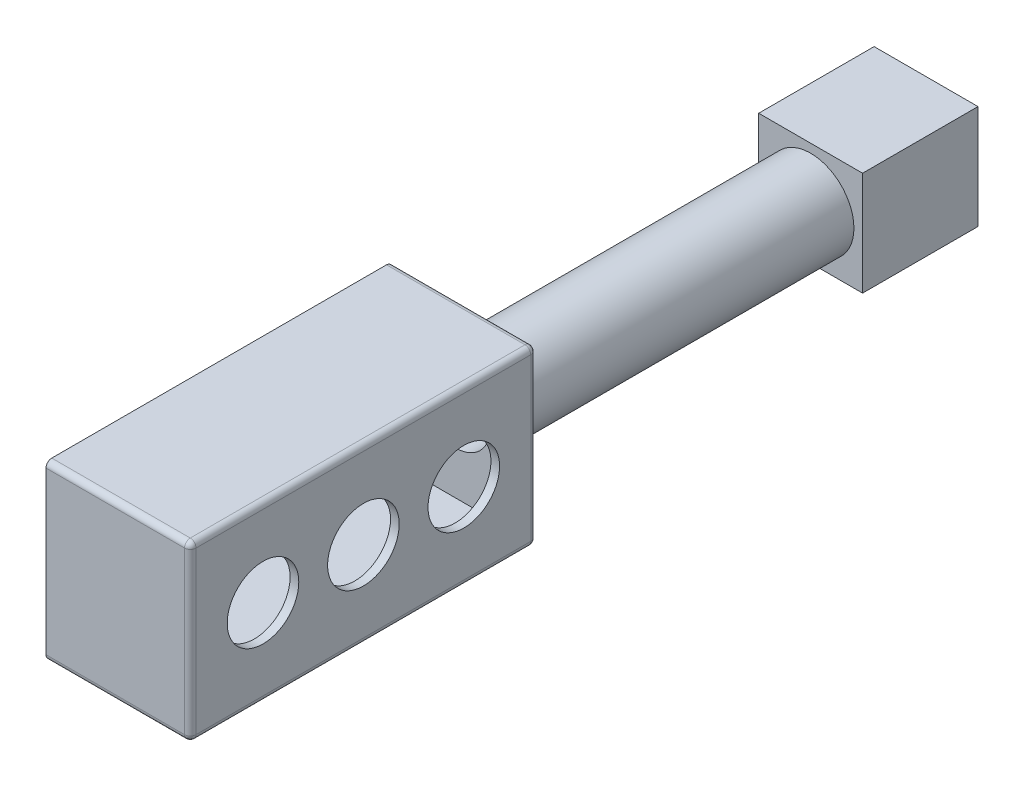
ISO-10303-21;
HEADER;
FILE_DESCRIPTION(('STEP AP214'),'2;1');
FILE_NAME('part.step','',(''),(''),'','','');
FILE_SCHEMA(('AUTOMOTIVE_DESIGN { 1 0 10303 214 1 1 1 1 }'));
ENDSEC;
DATA;
#1=APPLICATION_CONTEXT('core data for automotive mechanical design processes');
#2=APPLICATION_PROTOCOL_DEFINITION('international standard','automotive_design',2000,#1);
#3=PRODUCT_CONTEXT('',#1,'mechanical');
#4=PRODUCT('Part','Part','',(#3));
#5=PRODUCT_RELATED_PRODUCT_CATEGORY('part','',(#4));
#6=PRODUCT_DEFINITION_FORMATION('','',#4);
#7=PRODUCT_DEFINITION_CONTEXT('part definition',#1,'design');
#8=PRODUCT_DEFINITION('design','',#6,#7);
#9=PRODUCT_DEFINITION_SHAPE('','',#8);
#10=(LENGTH_UNIT() NAMED_UNIT(*) SI_UNIT(.MILLI.,.METRE.));
#11=(NAMED_UNIT(*) PLANE_ANGLE_UNIT() SI_UNIT($,.RADIAN.));
#12=(NAMED_UNIT(*) SI_UNIT($,.STERADIAN.) SOLID_ANGLE_UNIT());
#13=UNCERTAINTY_MEASURE_WITH_UNIT(LENGTH_MEASURE(1.E-05),#10,'distance_accuracy_value','');
#14=(GEOMETRIC_REPRESENTATION_CONTEXT(3) GLOBAL_UNCERTAINTY_ASSIGNED_CONTEXT((#13)) GLOBAL_UNIT_ASSIGNED_CONTEXT((#10,
#11,#12)) REPRESENTATION_CONTEXT('',''));
#15=CARTESIAN_POINT('',(0.,0.,0.));
#16=DIRECTION('',(0.,0.,1.));
#17=DIRECTION('',(1.,0.,0.));
#18=AXIS2_PLACEMENT_3D('',#15,#16,#17);
#19=CARTESIAN_POINT('',(-7.5,-7.5,-18.5));
#20=DIRECTION('',(0.,-1.,0.));
#21=DIRECTION('',(0.,0.,-1.));
#22=AXIS2_PLACEMENT_3D('',#19,#20,#21);
#23=PLANE('',#22);
#24=DIRECTION('',(0.,0.,1.));
#25=VECTOR('',#24,1.);
#26=CARTESIAN_POINT('',(7.5,-7.5,-18.5));
#27=LINE('',#26,#25);
#28=CARTESIAN_POINT('',(7.5,-7.5,-10.));
#29=VERTEX_POINT('',#28);
#30=CARTESIAN_POINT('',(7.5,-7.5,-1.5));
#31=VERTEX_POINT('',#30);
#32=EDGE_CURVE('E208',#29,#31,#27,.T.);
#33=ORIENTED_EDGE('',*,*,#32,.F.);
#34=CARTESIAN_POINT('',(0.,-7.5,-10.));
#35=DIRECTION('',(0.,-1.,0.));
#36=DIRECTION('',(0.,0.,-1.));
#37=AXIS2_PLACEMENT_3D('',#34,#35,#36);
#38=CIRCLE('',#37,7.5);
#39=CARTESIAN_POINT('',(-7.5,-7.5,-10.));
#40=VERTEX_POINT('',#39);
#41=EDGE_CURVE('E197',#29,#40,#38,.T.);
#42=ORIENTED_EDGE('',*,*,#41,.T.);
#43=DIRECTION('',(0.,0.,1.));
#44=VECTOR('',#43,1.);
#45=CARTESIAN_POINT('',(-7.5,-7.5,-18.5));
#46=LINE('',#45,#44);
#47=CARTESIAN_POINT('',(-7.5,-7.5,-1.5));
#48=VERTEX_POINT('',#47);
#49=EDGE_CURVE('E206',#40,#48,#46,.T.);
#50=ORIENTED_EDGE('',*,*,#49,.T.);
#51=DIRECTION('',(1.,0.,0.));
#52=VECTOR('',#51,1.);
#53=CARTESIAN_POINT('',(-7.5,-7.5,-1.5));
#54=LINE('',#53,#52);
#55=EDGE_CURVE('E420',#48,#31,#54,.T.);
#56=ORIENTED_EDGE('',*,*,#55,.T.);
#57=EDGE_LOOP('',(#33,#42,#50,#56));
#58=FACE_BOUND('',#57,.T.);
#59=ADVANCED_FACE('F40',(#58),#23,.F.);
#60=CARTESIAN_POINT('',(7.5,7.5,-18.5));
#61=DIRECTION('',(1.,0.,0.));
#62=DIRECTION('',(0.,1.,0.));
#63=AXIS2_PLACEMENT_3D('',#60,#61,#62);
#64=PLANE('',#63);
#65=DIRECTION('',(0.,1.,0.));
#66=VECTOR('',#65,1.);
#67=CARTESIAN_POINT('',(7.5,7.5,-1.5));
#68=LINE('',#67,#66);
#69=CARTESIAN_POINT('',(7.5,7.5,-1.5));
#70=VERTEX_POINT('',#69);
#71=EDGE_CURVE('E415',#31,#70,#68,.T.);
#72=ORIENTED_EDGE('',*,*,#71,.T.);
#73=DIRECTION('',(0.,0.,1.));
#74=VECTOR('',#73,1.);
#75=CARTESIAN_POINT('',(7.5,7.5,-18.5));
#76=LINE('',#75,#74);
#77=CARTESIAN_POINT('',(7.5,7.5,-18.5));
#78=VERTEX_POINT('',#77);
#79=EDGE_CURVE('E230',#78,#70,#76,.T.);
#80=ORIENTED_EDGE('',*,*,#79,.F.);
#81=DIRECTION('',(0.,1.,0.));
#82=VECTOR('',#81,1.);
#83=CARTESIAN_POINT('',(7.5,7.5,-18.5));
#84=LINE('',#83,#82);
#85=CARTESIAN_POINT('',(7.5,-7.5,-18.5));
#86=VERTEX_POINT('',#85);
#87=EDGE_CURVE('E416',#86,#78,#84,.T.);
#88=ORIENTED_EDGE('',*,*,#87,.F.);
#89=EDGE_CURVE('E225',#86,#29,#27,.T.);
#90=ORIENTED_EDGE('',*,*,#89,.T.);
#91=ORIENTED_EDGE('',*,*,#32,.T.);
#92=EDGE_LOOP('',(#72,#80,#88,#90,#91));
#93=FACE_BOUND('',#92,.T.);
#94=ADVANCED_FACE('F436',(#93),#64,.F.);
#95=CARTESIAN_POINT('',(-7.5,-7.5,-18.5));
#96=VERTEX_POINT('',#95);
#97=EDGE_CURVE('E214',#96,#40,#46,.T.);
#98=ORIENTED_EDGE('',*,*,#97,.T.);
#99=EDGE_CURVE('E193',#40,#29,#38,.T.);
#100=ORIENTED_EDGE('',*,*,#99,.T.);
#101=ORIENTED_EDGE('',*,*,#89,.F.);
#102=DIRECTION('',(1.,0.,0.));
#103=VECTOR('',#102,1.);
#104=CARTESIAN_POINT('',(-7.5,-7.5,-18.5));
#105=LINE('',#104,#103);
#106=EDGE_CURVE('E224',#96,#86,#105,.T.);
#107=ORIENTED_EDGE('',*,*,#106,.F.);
#108=EDGE_LOOP('',(#98,#100,#101,#107));
#109=FACE_BOUND('',#108,.T.);
#110=ADVANCED_FACE('F222',(#109),#23,.F.);
#111=CARTESIAN_POINT('',(-7.5,7.5,-18.5));
#112=DIRECTION('',(-1.,0.,0.));
#113=DIRECTION('',(0.,-1.,0.));
#114=AXIS2_PLACEMENT_3D('',#111,#112,#113);
#115=PLANE('',#114);
#116=DIRECTION('',(0.,-1.,0.));
#117=VECTOR('',#116,1.);
#118=CARTESIAN_POINT('',(-7.5,7.5,-1.5));
#119=LINE('',#118,#117);
#120=CARTESIAN_POINT('',(-7.5,7.5,-1.5));
#121=VERTEX_POINT('',#120);
#122=EDGE_CURVE('E217',#121,#48,#119,.T.);
#123=ORIENTED_EDGE('',*,*,#122,.T.);
#124=ORIENTED_EDGE('',*,*,#49,.F.);
#125=ORIENTED_EDGE('',*,*,#97,.F.);
#126=DIRECTION('',(0.,-1.,0.));
#127=VECTOR('',#126,1.);
#128=CARTESIAN_POINT('',(-7.5,7.5,-18.5));
#129=LINE('',#128,#127);
#130=CARTESIAN_POINT('',(-7.5,7.5,-18.5));
#131=VERTEX_POINT('',#130);
#132=EDGE_CURVE('E423',#131,#96,#129,.T.);
#133=ORIENTED_EDGE('',*,*,#132,.F.);
#134=DIRECTION('',(0.,0.,1.));
#135=VECTOR('',#134,1.);
#136=CARTESIAN_POINT('',(-7.5,7.5,-18.5));
#137=LINE('',#136,#135);
#138=EDGE_CURVE('E219',#131,#121,#137,.T.);
#139=ORIENTED_EDGE('',*,*,#138,.T.);
#140=EDGE_LOOP('',(#123,#124,#125,#133,#139));
#141=FACE_BOUND('',#140,.T.);
#142=ADVANCED_FACE('F212',(#141),#115,.F.);
#143=CARTESIAN_POINT('',(-7.5,7.5,-18.5));
#144=DIRECTION('',(0.,1.,0.));
#145=DIRECTION('',(0.,0.,1.));
#146=AXIS2_PLACEMENT_3D('',#143,#144,#145);
#147=PLANE('',#146);
#148=DIRECTION('',(-1.,0.,0.));
#149=VECTOR('',#148,1.);
#150=CARTESIAN_POINT('',(-7.5,7.5,-1.5));
#151=LINE('',#150,#149);
#152=EDGE_CURVE('E428',#70,#121,#151,.T.);
#153=ORIENTED_EDGE('',*,*,#152,.T.);
#154=ORIENTED_EDGE('',*,*,#138,.F.);
#155=DIRECTION('',(-1.,0.,0.));
#156=VECTOR('',#155,1.);
#157=CARTESIAN_POINT('',(-7.5,7.5,-18.5));
#158=LINE('',#157,#156);
#159=EDGE_CURVE('E419',#78,#131,#158,.T.);
#160=ORIENTED_EDGE('',*,*,#159,.F.);
#161=ORIENTED_EDGE('',*,*,#79,.T.);
#162=EDGE_LOOP('',(#153,#154,#160,#161));
#163=FACE_BOUND('',#162,.T.);
#164=ADVANCED_FACE('F442',(#163),#147,.F.);
#165=CARTESIAN_POINT('',(0.,0.,-18.5));
#166=DIRECTION('',(0.,0.,1.));
#167=DIRECTION('',(1.,0.,0.));
#168=AXIS2_PLACEMENT_3D('',#165,#166,#167);
#169=PLANE('',#168);
#170=ORIENTED_EDGE('',*,*,#87,.T.);
#171=ORIENTED_EDGE('',*,*,#159,.T.);
#172=ORIENTED_EDGE('',*,*,#132,.T.);
#173=ORIENTED_EDGE('',*,*,#106,.T.);
#174=EDGE_LOOP('',(#170,#171,#172,#173));
#175=FACE_BOUND('',#174,.T.);
#176=ADVANCED_FACE('F440',(#175),#169,.T.);
#177=CARTESIAN_POINT('',(0.,0.,-1.5));
#178=DIRECTION('',(0.,0.,1.));
#179=DIRECTION('',(1.,0.,0.));
#180=AXIS2_PLACEMENT_3D('',#177,#178,#179);
#181=PLANE('',#180);
#182=CARTESIAN_POINT('',(0.,0.,-1.5));
#183=DIRECTION('',(0.,0.,1.));
#184=DIRECTION('',(1.,0.,0.));
#185=AXIS2_PLACEMENT_3D('',#182,#183,#184);
#186=CIRCLE('',#185,6.);
#187=CARTESIAN_POINT('',(6.,0.,-1.5));
#188=VERTEX_POINT('',#187);
#189=EDGE_CURVE('E210',#188,#188,#186,.T.);
#190=ORIENTED_EDGE('',*,*,#189,.T.);
#191=EDGE_LOOP('',(#190));
#192=FACE_BOUND('',#191,.T.);
#193=ORIENTED_EDGE('',*,*,#71,.F.);
#194=ORIENTED_EDGE('',*,*,#55,.F.);
#195=ORIENTED_EDGE('',*,*,#122,.F.);
#196=ORIENTED_EDGE('',*,*,#152,.F.);
#197=EDGE_LOOP('',(#193,#194,#195,#196));
#198=FACE_BOUND('',#197,.T.);
#199=ADVANCED_FACE('F433',(#192,#198),#181,.F.);
#200=CARTESIAN_POINT('',(11.,-15.,120.));
#201=DIRECTION('',(-1.,0.,0.));
#202=DIRECTION('',(0.,0.,1.));
#203=AXIS2_PLACEMENT_3D('',#200,#201,#202);
#204=PLANE('',#203);
#205=DIRECTION('',(0.,1.,0.));
#206=VECTOR('',#205,1.);
#207=CARTESIAN_POINT('',(11.,0.,61.5));
#208=LINE('',#207,#206);
#209=CARTESIAN_POINT('',(11.,-13.5,61.5));
#210=VERTEX_POINT('',#209);
#211=CARTESIAN_POINT('',(11.,13.5,61.5));
#212=VERTEX_POINT('',#211);
#213=EDGE_CURVE('E281',#210,#212,#208,.T.);
#214=ORIENTED_EDGE('',*,*,#213,.F.);
#215=DIRECTION('',(0.,0.,-1.));
#216=VECTOR('',#215,1.);
#217=CARTESIAN_POINT('',(11.,-13.5,120.));
#218=LINE('',#217,#216);
#219=CARTESIAN_POINT('',(11.,-13.5,118.5));
#220=VERTEX_POINT('',#219);
#221=EDGE_CURVE('E297',#220,#210,#218,.T.);
#222=ORIENTED_EDGE('',*,*,#221,.F.);
#223=DIRECTION('',(0.,1.,0.));
#224=VECTOR('',#223,1.);
#225=CARTESIAN_POINT('',(11.,0.,118.5));
#226=LINE('',#225,#224);
#227=CARTESIAN_POINT('',(11.,13.5,118.5));
#228=VERTEX_POINT('',#227);
#229=EDGE_CURVE('E294',#220,#228,#226,.T.);
#230=ORIENTED_EDGE('',*,*,#229,.T.);
#231=DIRECTION('',(0.,0.,-1.));
#232=VECTOR('',#231,1.);
#233=CARTESIAN_POINT('',(11.,13.5,120.));
#234=LINE('',#233,#232);
#235=EDGE_CURVE('E288',#228,#212,#234,.T.);
#236=ORIENTED_EDGE('',*,*,#235,.T.);
#237=EDGE_LOOP('',(#214,#222,#230,#236));
#238=FACE_BOUND('',#237,.T.);
#239=CARTESIAN_POINT('',(11.,0.,107.4));
#240=DIRECTION('',(1.,0.,0.));
#241=DIRECTION('',(0.,0.,-1.));
#242=AXIS2_PLACEMENT_3D('',#239,#240,#241);
#243=CIRCLE('',#242,6.2);
#244=CARTESIAN_POINT('',(11.,0.,101.2));
#245=VERTEX_POINT('',#244);
#246=EDGE_CURVE('E269',#245,#245,#243,.T.);
#247=ORIENTED_EDGE('',*,*,#246,.T.);
#248=EDGE_LOOP('',(#247));
#249=FACE_BOUND('',#248,.T.);
#250=CARTESIAN_POINT('',(11.,0.,72.6));
#251=DIRECTION('',(1.,0.,0.));
#252=DIRECTION('',(0.,0.,1.));
#253=AXIS2_PLACEMENT_3D('',#250,#251,#252);
#254=CIRCLE('',#253,6.2);
#255=CARTESIAN_POINT('',(11.,0.,78.8));
#256=VERTEX_POINT('',#255);
#257=EDGE_CURVE('E275',#256,#256,#254,.T.);
#258=ORIENTED_EDGE('',*,*,#257,.T.);
#259=EDGE_LOOP('',(#258));
#260=FACE_BOUND('',#259,.T.);
#261=CARTESIAN_POINT('',(11.,0.,90.));
#262=DIRECTION('',(1.,0.,0.));
#263=DIRECTION('',(0.,0.,-1.));
#264=AXIS2_PLACEMENT_3D('',#261,#262,#263);
#265=CIRCLE('',#264,6.2);
#266=CARTESIAN_POINT('',(11.,0.,83.8));
#267=VERTEX_POINT('',#266);
#268=EDGE_CURVE('E278',#267,#267,#265,.T.);
#269=ORIENTED_EDGE('',*,*,#268,.T.);
#270=EDGE_LOOP('',(#269));
#271=FACE_BOUND('',#270,.T.);
#272=ADVANCED_FACE('F509',(#238,#249,#260,#271),#204,.T.);
#273=CARTESIAN_POINT('',(-12.5,-15.,120.));
#274=DIRECTION('',(1.,0.,0.));
#275=DIRECTION('',(0.,0.,-1.));
#276=AXIS2_PLACEMENT_3D('',#273,#274,#275);
#277=PLANE('',#276);
#278=DIRECTION('',(0.,0.,-1.));
#279=VECTOR('',#278,1.);
#280=CARTESIAN_POINT('',(-12.5,-15.,120.));
#281=LINE('',#280,#279);
#282=CARTESIAN_POINT('',(-12.5,-15.,119.));
#283=VERTEX_POINT('',#282);
#284=CARTESIAN_POINT('',(-12.5,-15.,61.));
#285=VERTEX_POINT('',#284);
#286=EDGE_CURVE('E322',#283,#285,#281,.T.);
#287=ORIENTED_EDGE('',*,*,#286,.F.);
#288=CARTESIAN_POINT('',(-12.5,-14.,119.));
#289=DIRECTION('',(1.,0.,0.));
#290=DIRECTION('',(0.,0.,-1.));
#291=AXIS2_PLACEMENT_3D('',#288,#289,#290);
#292=CIRCLE('',#291,1.);
#293=CARTESIAN_POINT('',(-12.5,-14.,120.));
#294=VERTEX_POINT('',#293);
#295=EDGE_CURVE('E354',#283,#294,#292,.F.);
#296=ORIENTED_EDGE('',*,*,#295,.T.);
#297=DIRECTION('',(0.,-1.,0.));
#298=VECTOR('',#297,1.);
#299=CARTESIAN_POINT('',(-12.5,-15.,120.));
#300=LINE('',#299,#298);
#301=CARTESIAN_POINT('',(-12.5,14.,120.));
#302=VERTEX_POINT('',#301);
#303=EDGE_CURVE('E319',#302,#294,#300,.T.);
#304=ORIENTED_EDGE('',*,*,#303,.F.);
#305=CARTESIAN_POINT('',(-12.5,14.,119.));
#306=DIRECTION('',(1.,0.,0.));
#307=DIRECTION('',(0.,0.,-1.));
#308=AXIS2_PLACEMENT_3D('',#305,#306,#307);
#309=CIRCLE('',#308,1.);
#310=CARTESIAN_POINT('',(-12.5,15.,119.));
#311=VERTEX_POINT('',#310);
#312=EDGE_CURVE('E348',#302,#311,#309,.F.);
#313=ORIENTED_EDGE('',*,*,#312,.T.);
#314=DIRECTION('',(0.,0.,-1.));
#315=VECTOR('',#314,1.);
#316=CARTESIAN_POINT('',(-12.5,15.,120.));
#317=LINE('',#316,#315);
#318=CARTESIAN_POINT('',(-12.5,15.,61.));
#319=VERTEX_POINT('',#318);
#320=EDGE_CURVE('E327',#311,#319,#317,.T.);
#321=ORIENTED_EDGE('',*,*,#320,.T.);
#322=CARTESIAN_POINT('',(-12.5,14.,61.));
#323=DIRECTION('',(1.,0.,0.));
#324=DIRECTION('',(0.,0.,-1.));
#325=AXIS2_PLACEMENT_3D('',#322,#323,#324);
#326=CIRCLE('',#325,1.);
#327=CARTESIAN_POINT('',(-12.5,14.,60.));
#328=VERTEX_POINT('',#327);
#329=EDGE_CURVE('E350',#319,#328,#326,.F.);
#330=ORIENTED_EDGE('',*,*,#329,.T.);
#331=DIRECTION('',(0.,-1.,0.));
#332=VECTOR('',#331,1.);
#333=CARTESIAN_POINT('',(-12.5,-15.,60.));
#334=LINE('',#333,#332);
#335=CARTESIAN_POINT('',(-12.5,-14.,60.));
#336=VERTEX_POINT('',#335);
#337=EDGE_CURVE('E287',#328,#336,#334,.T.);
#338=ORIENTED_EDGE('',*,*,#337,.T.);
#339=CARTESIAN_POINT('',(-12.5,-14.,61.));
#340=DIRECTION('',(1.,0.,0.));
#341=DIRECTION('',(0.,0.,-1.));
#342=AXIS2_PLACEMENT_3D('',#339,#340,#341);
#343=CIRCLE('',#342,1.);
#344=EDGE_CURVE('E352',#336,#285,#343,.F.);
#345=ORIENTED_EDGE('',*,*,#344,.T.);
#346=EDGE_LOOP('',(#287,#296,#304,#313,#321,#330,#338,#345));
#347=FACE_BOUND('',#346,.T.);
#348=DIRECTION('',(0.,-1.,0.));
#349=VECTOR('',#348,1.);
#350=CARTESIAN_POINT('',(-12.5,0.,61.5));
#351=LINE('',#350,#349);
#352=CARTESIAN_POINT('',(-12.5,13.5,61.5));
#353=VERTEX_POINT('',#352);
#354=CARTESIAN_POINT('',(-12.5,-13.5,61.5));
#355=VERTEX_POINT('',#354);
#356=EDGE_CURVE('E295',#353,#355,#351,.T.);
#357=ORIENTED_EDGE('',*,*,#356,.F.);
#358=DIRECTION('',(0.,0.,-1.));
#359=VECTOR('',#358,1.);
#360=CARTESIAN_POINT('',(-12.5,13.5,120.));
#361=LINE('',#360,#359);
#362=CARTESIAN_POINT('',(-12.5,13.5,118.5));
#363=VERTEX_POINT('',#362);
#364=EDGE_CURVE('E311',#363,#353,#361,.T.);
#365=ORIENTED_EDGE('',*,*,#364,.F.);
#366=DIRECTION('',(0.,-1.,0.));
#367=VECTOR('',#366,1.);
#368=CARTESIAN_POINT('',(-12.5,0.,118.5));
#369=LINE('',#368,#367);
#370=CARTESIAN_POINT('',(-12.5,-13.5,118.5));
#371=VERTEX_POINT('',#370);
#372=EDGE_CURVE('E303',#363,#371,#369,.T.);
#373=ORIENTED_EDGE('',*,*,#372,.T.);
#374=DIRECTION('',(0.,0.,-1.));
#375=VECTOR('',#374,1.);
#376=CARTESIAN_POINT('',(-12.5,-13.5,120.));
#377=LINE('',#376,#375);
#378=EDGE_CURVE('E300',#371,#355,#377,.T.);
#379=ORIENTED_EDGE('',*,*,#378,.T.);
#380=EDGE_LOOP('',(#357,#365,#373,#379));
#381=FACE_BOUND('',#380,.T.);
#382=ADVANCED_FACE('F503',(#347,#381),#277,.F.);
#383=CARTESIAN_POINT('',(0.,0.,60.));
#384=DIRECTION('',(0.,0.,-1.));
#385=DIRECTION('',(-1.,0.,0.));
#386=AXIS2_PLACEMENT_3D('',#383,#384,#385);
#387=CYLINDRICAL_SURFACE('',#386,7.5);
#388=CARTESIAN_POINT('',(0.,0.,60.));
#389=DIRECTION('',(0.,0.,1.));
#390=DIRECTION('',(1.,0.,0.));
#391=AXIS2_PLACEMENT_3D('',#388,#389,#390);
#392=CIRCLE('',#391,7.5);
#393=CARTESIAN_POINT('',(7.5,0.,60.));
#394=VERTEX_POINT('',#393);
#395=EDGE_CURVE('E330',#394,#394,#392,.T.);
#396=ORIENTED_EDGE('',*,*,#395,.F.);
#397=EDGE_LOOP('',(#396));
#398=FACE_BOUND('',#397,.T.);
#399=CARTESIAN_POINT('',(0.,0.,0.));
#400=DIRECTION('',(0.,0.,1.));
#401=DIRECTION('',(1.,0.,0.));
#402=AXIS2_PLACEMENT_3D('',#399,#400,#401);
#403=CIRCLE('',#402,7.5);
#404=CARTESIAN_POINT('',(7.5,0.,0.));
#405=VERTEX_POINT('',#404);
#406=EDGE_CURVE('E259',#405,#405,#403,.T.);
#407=ORIENTED_EDGE('',*,*,#406,.T.);
#408=EDGE_LOOP('',(#407));
#409=FACE_BOUND('',#408,.T.);
#410=ADVANCED_FACE('F508',(#398,#409),#387,.T.);
#411=CARTESIAN_POINT('',(0.,0.,60.));
#412=DIRECTION('',(0.,0.,-1.));
#413=DIRECTION('',(-1.,0.,0.));
#414=AXIS2_PLACEMENT_3D('',#411,#412,#413);
#415=CYLINDRICAL_SURFACE('',#414,6.);
#416=CARTESIAN_POINT('',(0.,0.,61.5));
#417=DIRECTION('',(0.,0.,-1.));
#418=DIRECTION('',(-1.,0.,0.));
#419=AXIS2_PLACEMENT_3D('',#416,#417,#418);
#420=CIRCLE('',#419,6.);
#421=CARTESIAN_POINT('',(-6.,0.,61.5));
#422=VERTEX_POINT('',#421);
#423=EDGE_CURVE('E284',#422,#422,#420,.F.);
#424=ORIENTED_EDGE('',*,*,#423,.T.);
#425=EDGE_LOOP('',(#424));
#426=FACE_BOUND('',#425,.T.);
#427=ORIENTED_EDGE('',*,*,#189,.F.);
#428=EDGE_LOOP('',(#427));
#429=FACE_BOUND('',#428,.T.);
#430=ADVANCED_FACE('F525',(#426,#429),#415,.F.);
#431=CARTESIAN_POINT('',(0.,0.,60.));
#432=DIRECTION('',(0.,0.,-1.));
#433=DIRECTION('',(-1.,0.,0.));
#434=AXIS2_PLACEMENT_3D('',#431,#432,#433);
#435=PLANE('',#434);
#436=ORIENTED_EDGE('',*,*,#395,.T.);
#437=EDGE_LOOP('',(#436));
#438=FACE_BOUND('',#437,.T.);
#439=DIRECTION('',(0.,1.,0.));
#440=VECTOR('',#439,1.);
#441=CARTESIAN_POINT('',(11.5,-15.,60.));
#442=LINE('',#441,#440);
#443=CARTESIAN_POINT('',(11.5,14.,60.));
#444=VERTEX_POINT('',#443);
#445=CARTESIAN_POINT('',(11.5,-14.,60.));
#446=VERTEX_POINT('',#445);
#447=EDGE_CURVE('E356',#444,#446,#442,.F.);
#448=ORIENTED_EDGE('',*,*,#447,.T.);
#449=DIRECTION('',(1.,0.,0.));
#450=VECTOR('',#449,1.);
#451=CARTESIAN_POINT('',(-12.5,-14.,60.));
#452=LINE('',#451,#450);
#453=EDGE_CURVE('E360',#446,#336,#452,.F.);
#454=ORIENTED_EDGE('',*,*,#453,.T.);
#455=ORIENTED_EDGE('',*,*,#337,.F.);
#456=DIRECTION('',(-1.,0.,0.));
#457=VECTOR('',#456,1.);
#458=CARTESIAN_POINT('',(12.5,14.,60.));
#459=LINE('',#458,#457);
#460=EDGE_CURVE('E358',#328,#444,#459,.F.);
#461=ORIENTED_EDGE('',*,*,#460,.T.);
#462=EDGE_LOOP('',(#448,#454,#455,#461));
#463=FACE_BOUND('',#462,.T.);
#464=ADVANCED_FACE('F519',(#438,#463),#435,.T.);
#465=CARTESIAN_POINT('',(0.,0.,120.));
#466=DIRECTION('',(0.,0.,-1.));
#467=DIRECTION('',(-1.,0.,0.));
#468=AXIS2_PLACEMENT_3D('',#465,#466,#467);
#469=PLANE('',#468);
#470=ORIENTED_EDGE('',*,*,#303,.T.);
#471=DIRECTION('',(1.,0.,0.));
#472=VECTOR('',#471,1.);
#473=CARTESIAN_POINT('',(0.,-14.,120.));
#474=LINE('',#473,#472);
#475=CARTESIAN_POINT('',(11.5,-14.,120.));
#476=VERTEX_POINT('',#475);
#477=EDGE_CURVE('E339',#294,#476,#474,.T.);
#478=ORIENTED_EDGE('',*,*,#477,.T.);
#479=DIRECTION('',(0.,1.,0.));
#480=VECTOR('',#479,1.);
#481=CARTESIAN_POINT('',(11.5,0.,120.));
#482=LINE('',#481,#480);
#483=CARTESIAN_POINT('',(11.5,14.,120.));
#484=VERTEX_POINT('',#483);
#485=EDGE_CURVE('E337',#476,#484,#482,.T.);
#486=ORIENTED_EDGE('',*,*,#485,.T.);
#487=DIRECTION('',(-1.,0.,0.));
#488=VECTOR('',#487,1.);
#489=CARTESIAN_POINT('',(0.,14.,120.));
#490=LINE('',#489,#488);
#491=EDGE_CURVE('E333',#484,#302,#490,.T.);
#492=ORIENTED_EDGE('',*,*,#491,.T.);
#493=EDGE_LOOP('',(#470,#478,#486,#492));
#494=FACE_BOUND('',#493,.T.);
#495=ADVANCED_FACE('F524',(#494),#469,.F.);
#496=CARTESIAN_POINT('',(-12.5,-15.,120.));
#497=DIRECTION('',(0.,1.,0.));
#498=DIRECTION('',(0.,0.,1.));
#499=AXIS2_PLACEMENT_3D('',#496,#497,#498);
#500=PLANE('',#499);
#501=DIRECTION('',(0.,0.,-1.));
#502=VECTOR('',#501,1.);
#503=CARTESIAN_POINT('',(11.5,-15.,120.));
#504=LINE('',#503,#502);
#505=CARTESIAN_POINT('',(11.5,-15.,61.));
#506=VERTEX_POINT('',#505);
#507=CARTESIAN_POINT('',(11.5,-15.,119.));
#508=VERTEX_POINT('',#507);
#509=EDGE_CURVE('E342',#506,#508,#504,.F.);
#510=ORIENTED_EDGE('',*,*,#509,.T.);
#511=DIRECTION('',(1.,0.,0.));
#512=VECTOR('',#511,1.);
#513=CARTESIAN_POINT('',(-12.5,-15.,119.));
#514=LINE('',#513,#512);
#515=EDGE_CURVE('E346',#508,#283,#514,.F.);
#516=ORIENTED_EDGE('',*,*,#515,.T.);
#517=ORIENTED_EDGE('',*,*,#286,.T.);
#518=DIRECTION('',(1.,0.,0.));
#519=VECTOR('',#518,1.);
#520=CARTESIAN_POINT('',(12.5,-15.,61.));
#521=LINE('',#520,#519);
#522=EDGE_CURVE('E344',#285,#506,#521,.T.);
#523=ORIENTED_EDGE('',*,*,#522,.T.);
#524=EDGE_LOOP('',(#510,#516,#517,#523));
#525=FACE_BOUND('',#524,.T.);
#526=ADVANCED_FACE('F538',(#525),#500,.F.);
#527=CARTESIAN_POINT('',(-12.5,15.,120.));
#528=DIRECTION('',(0.,-1.,0.));
#529=DIRECTION('',(0.,0.,-1.));
#530=AXIS2_PLACEMENT_3D('',#527,#528,#529);
#531=PLANE('',#530);
#532=DIRECTION('',(0.,0.,-1.));
#533=VECTOR('',#532,1.);
#534=CARTESIAN_POINT('',(11.5,15.,120.));
#535=LINE('',#534,#533);
#536=CARTESIAN_POINT('',(11.5,15.,119.));
#537=VERTEX_POINT('',#536);
#538=CARTESIAN_POINT('',(11.5,15.,61.));
#539=VERTEX_POINT('',#538);
#540=EDGE_CURVE('E56',#537,#539,#535,.T.);
#541=ORIENTED_EDGE('',*,*,#540,.T.);
#542=DIRECTION('',(-1.,0.,0.));
#543=VECTOR('',#542,1.);
#544=CARTESIAN_POINT('',(-12.5,15.,61.));
#545=LINE('',#544,#543);
#546=EDGE_CURVE('E11',#539,#319,#545,.T.);
#547=ORIENTED_EDGE('',*,*,#546,.T.);
#548=ORIENTED_EDGE('',*,*,#320,.F.);
#549=DIRECTION('',(-1.,0.,0.));
#550=VECTOR('',#549,1.);
#551=CARTESIAN_POINT('',(-12.5,15.,119.));
#552=LINE('',#551,#550);
#553=EDGE_CURVE('E49',#311,#537,#552,.F.);
#554=ORIENTED_EDGE('',*,*,#553,.T.);
#555=EDGE_LOOP('',(#541,#547,#548,#554));
#556=FACE_BOUND('',#555,.T.);
#557=ADVANCED_FACE('F549',(#556),#531,.F.);
#558=CARTESIAN_POINT('',(12.5,-15.,120.));
#559=DIRECTION('',(-1.,0.,0.));
#560=DIRECTION('',(0.,0.,1.));
#561=AXIS2_PLACEMENT_3D('',#558,#559,#560);
#562=PLANE('',#561);
#563=DIRECTION('',(0.,1.,0.));
#564=VECTOR('',#563,1.);
#565=CARTESIAN_POINT('',(12.5,-15.,119.));
#566=LINE('',#565,#564);
#567=CARTESIAN_POINT('',(12.5,14.,119.));
#568=VERTEX_POINT('',#567);
#569=CARTESIAN_POINT('',(12.5,-14.,119.));
#570=VERTEX_POINT('',#569);
#571=EDGE_CURVE('E364',#568,#570,#566,.F.);
#572=ORIENTED_EDGE('',*,*,#571,.T.);
#573=DIRECTION('',(0.,0.,-1.));
#574=VECTOR('',#573,1.);
#575=CARTESIAN_POINT('',(12.5,-14.,120.));
#576=LINE('',#575,#574);
#577=CARTESIAN_POINT('',(12.5,-14.,61.));
#578=VERTEX_POINT('',#577);
#579=EDGE_CURVE('E368',#570,#578,#576,.T.);
#580=ORIENTED_EDGE('',*,*,#579,.T.);
#581=DIRECTION('',(0.,1.,0.));
#582=VECTOR('',#581,1.);
#583=CARTESIAN_POINT('',(12.5,15.,61.));
#584=LINE('',#583,#582);
#585=CARTESIAN_POINT('',(12.5,14.,61.));
#586=VERTEX_POINT('',#585);
#587=EDGE_CURVE('E366',#578,#586,#584,.T.);
#588=ORIENTED_EDGE('',*,*,#587,.T.);
#589=DIRECTION('',(0.,0.,-1.));
#590=VECTOR('',#589,1.);
#591=CARTESIAN_POINT('',(12.5,14.,120.));
#592=LINE('',#591,#590);
#593=EDGE_CURVE('E362',#586,#568,#592,.F.);
#594=ORIENTED_EDGE('',*,*,#593,.T.);
#595=EDGE_LOOP('',(#572,#580,#588,#594));
#596=FACE_BOUND('',#595,.T.);
#597=CARTESIAN_POINT('',(12.5,0.,72.6));
#598=DIRECTION('',(1.,0.,0.));
#599=DIRECTION('',(0.,0.,1.));
#600=AXIS2_PLACEMENT_3D('',#597,#598,#599);
#601=CIRCLE('',#600,6.2);
#602=CARTESIAN_POINT('',(12.5,0.,78.8));
#603=VERTEX_POINT('',#602);
#604=EDGE_CURVE('E272',#603,#603,#601,.T.);
#605=ORIENTED_EDGE('',*,*,#604,.F.);
#606=EDGE_LOOP('',(#605));
#607=FACE_BOUND('',#606,.T.);
#608=CARTESIAN_POINT('',(12.5,0.,107.4));
#609=DIRECTION('',(1.,0.,0.));
#610=DIRECTION('',(0.,0.,-1.));
#611=AXIS2_PLACEMENT_3D('',#608,#609,#610);
#612=CIRCLE('',#611,6.2);
#613=CARTESIAN_POINT('',(12.5,0.,101.2));
#614=VERTEX_POINT('',#613);
#615=EDGE_CURVE('E265',#614,#614,#612,.T.);
#616=ORIENTED_EDGE('',*,*,#615,.F.);
#617=EDGE_LOOP('',(#616));
#618=FACE_BOUND('',#617,.T.);
#619=CARTESIAN_POINT('',(12.5,0.,90.));
#620=DIRECTION('',(1.,0.,0.));
#621=DIRECTION('',(0.,0.,-1.));
#622=AXIS2_PLACEMENT_3D('',#619,#620,#621);
#623=CIRCLE('',#622,6.2);
#624=CARTESIAN_POINT('',(12.5,0.,83.8));
#625=VERTEX_POINT('',#624);
#626=EDGE_CURVE('E268',#625,#625,#623,.T.);
#627=ORIENTED_EDGE('',*,*,#626,.F.);
#628=EDGE_LOOP('',(#627));
#629=FACE_BOUND('',#628,.T.);
#630=ADVANCED_FACE('F560',(#596,#607,#618,#629),#562,.F.);
#631=CARTESIAN_POINT('',(0.,0.,61.5));
#632=DIRECTION('',(0.,0.,-1.));
#633=DIRECTION('',(-1.,0.,0.));
#634=AXIS2_PLACEMENT_3D('',#631,#632,#633);
#635=PLANE('',#634);
#636=ORIENTED_EDGE('',*,*,#423,.F.);
#637=EDGE_LOOP('',(#636));
#638=FACE_BOUND('',#637,.T.);
#639=ORIENTED_EDGE('',*,*,#213,.T.);
#640=DIRECTION('',(-1.,0.,0.));
#641=VECTOR('',#640,1.);
#642=CARTESIAN_POINT('',(0.,13.5,61.5));
#643=LINE('',#642,#641);
#644=EDGE_CURVE('E291',#212,#353,#643,.T.);
#645=ORIENTED_EDGE('',*,*,#644,.T.);
#646=ORIENTED_EDGE('',*,*,#356,.T.);
#647=DIRECTION('',(1.,0.,0.));
#648=VECTOR('',#647,1.);
#649=CARTESIAN_POINT('',(0.,-13.5,61.5));
#650=LINE('',#649,#648);
#651=EDGE_CURVE('E292',#355,#210,#650,.T.);
#652=ORIENTED_EDGE('',*,*,#651,.T.);
#653=EDGE_LOOP('',(#639,#645,#646,#652));
#654=FACE_BOUND('',#653,.T.);
#655=ADVANCED_FACE('F571',(#638,#654),#635,.F.);
#656=CARTESIAN_POINT('',(0.,0.,118.5));
#657=DIRECTION('',(0.,0.,-1.));
#658=DIRECTION('',(-1.,0.,0.));
#659=AXIS2_PLACEMENT_3D('',#656,#657,#658);
#660=PLANE('',#659);
#661=ORIENTED_EDGE('',*,*,#229,.F.);
#662=DIRECTION('',(1.,0.,0.));
#663=VECTOR('',#662,1.);
#664=CARTESIAN_POINT('',(0.,-13.5,118.5));
#665=LINE('',#664,#663);
#666=EDGE_CURVE('E301',#371,#220,#665,.T.);
#667=ORIENTED_EDGE('',*,*,#666,.F.);
#668=ORIENTED_EDGE('',*,*,#372,.F.);
#669=DIRECTION('',(-1.,0.,0.));
#670=VECTOR('',#669,1.);
#671=CARTESIAN_POINT('',(0.,13.5,118.5));
#672=LINE('',#671,#670);
#673=EDGE_CURVE('E306',#228,#363,#672,.T.);
#674=ORIENTED_EDGE('',*,*,#673,.F.);
#675=EDGE_LOOP('',(#661,#667,#668,#674));
#676=FACE_BOUND('',#675,.T.);
#677=ADVANCED_FACE('F853',(#676),#660,.T.);
#678=CARTESIAN_POINT('',(-12.5,-13.5,120.));
#679=DIRECTION('',(0.,1.,0.));
#680=DIRECTION('',(0.,0.,1.));
#681=AXIS2_PLACEMENT_3D('',#678,#679,#680);
#682=PLANE('',#681);
#683=ORIENTED_EDGE('',*,*,#651,.F.);
#684=ORIENTED_EDGE('',*,*,#378,.F.);
#685=ORIENTED_EDGE('',*,*,#666,.T.);
#686=ORIENTED_EDGE('',*,*,#221,.T.);
#687=EDGE_LOOP('',(#683,#684,#685,#686));
#688=FACE_BOUND('',#687,.T.);
#689=ADVANCED_FACE('F843',(#688),#682,.T.);
#690=CARTESIAN_POINT('',(-12.5,13.5,120.));
#691=DIRECTION('',(0.,-1.,0.));
#692=DIRECTION('',(0.,0.,-1.));
#693=AXIS2_PLACEMENT_3D('',#690,#691,#692);
#694=PLANE('',#693);
#695=ORIENTED_EDGE('',*,*,#644,.F.);
#696=ORIENTED_EDGE('',*,*,#235,.F.);
#697=ORIENTED_EDGE('',*,*,#673,.T.);
#698=ORIENTED_EDGE('',*,*,#364,.T.);
#699=EDGE_LOOP('',(#695,#696,#697,#698));
#700=FACE_BOUND('',#699,.T.);
#701=ADVANCED_FACE('F821',(#700),#694,.T.);
#702=CARTESIAN_POINT('',(11.,0.,107.4));
#703=DIRECTION('',(1.,0.,0.));
#704=DIRECTION('',(0.,0.,-1.));
#705=AXIS2_PLACEMENT_3D('',#702,#703,#704);
#706=CYLINDRICAL_SURFACE('',#705,6.2);
#707=ORIENTED_EDGE('',*,*,#246,.F.);
#708=EDGE_LOOP('',(#707));
#709=FACE_BOUND('',#708,.T.);
#710=ORIENTED_EDGE('',*,*,#615,.T.);
#711=EDGE_LOOP('',(#710));
#712=FACE_BOUND('',#711,.T.);
#713=ADVANCED_FACE('F811',(#709,#712),#706,.F.);
#714=CARTESIAN_POINT('',(11.,0.,72.6));
#715=DIRECTION('',(1.,0.,0.));
#716=DIRECTION('',(0.,0.,-1.));
#717=AXIS2_PLACEMENT_3D('',#714,#715,#716);
#718=CYLINDRICAL_SURFACE('',#717,6.2);
#719=ORIENTED_EDGE('',*,*,#257,.F.);
#720=EDGE_LOOP('',(#719));
#721=FACE_BOUND('',#720,.T.);
#722=ORIENTED_EDGE('',*,*,#604,.T.);
#723=EDGE_LOOP('',(#722));
#724=FACE_BOUND('',#723,.T.);
#725=ADVANCED_FACE('F801',(#721,#724),#718,.F.);
#726=CARTESIAN_POINT('',(11.,0.,90.));
#727=DIRECTION('',(1.,0.,0.));
#728=DIRECTION('',(0.,0.,-1.));
#729=AXIS2_PLACEMENT_3D('',#726,#727,#728);
#730=CYLINDRICAL_SURFACE('',#729,6.2);
#731=ORIENTED_EDGE('',*,*,#268,.F.);
#732=EDGE_LOOP('',(#731));
#733=FACE_BOUND('',#732,.T.);
#734=ORIENTED_EDGE('',*,*,#626,.T.);
#735=EDGE_LOOP('',(#734));
#736=FACE_BOUND('',#735,.T.);
#737=ADVANCED_FACE('F791',(#733,#736),#730,.F.);
#738=CARTESIAN_POINT('',(0.,0.,0.));
#739=DIRECTION('',(0.,0.,-1.));
#740=DIRECTION('',(-1.,0.,0.));
#741=AXIS2_PLACEMENT_3D('',#738,#739,#740);
#742=PLANE('',#741);
#743=ORIENTED_EDGE('',*,*,#406,.F.);
#744=EDGE_LOOP('',(#743));
#745=FACE_BOUND('',#744,.T.);
#746=DIRECTION('',(0.,1.,0.));
#747=VECTOR('',#746,1.);
#748=CARTESIAN_POINT('',(9.,-9.,0.));
#749=LINE('',#748,#747);
#750=CARTESIAN_POINT('',(9.,-9.,0.));
#751=VERTEX_POINT('',#750);
#752=CARTESIAN_POINT('',(9.,9.,0.));
#753=VERTEX_POINT('',#752);
#754=EDGE_CURVE('E246',#751,#753,#749,.T.);
#755=ORIENTED_EDGE('',*,*,#754,.T.);
#756=DIRECTION('',(-1.,0.,0.));
#757=VECTOR('',#756,1.);
#758=CARTESIAN_POINT('',(-9.,9.,0.));
#759=LINE('',#758,#757);
#760=CARTESIAN_POINT('',(-9.,9.,0.));
#761=VERTEX_POINT('',#760);
#762=EDGE_CURVE('E249',#753,#761,#759,.T.);
#763=ORIENTED_EDGE('',*,*,#762,.T.);
#764=DIRECTION('',(0.,-1.,0.));
#765=VECTOR('',#764,1.);
#766=CARTESIAN_POINT('',(-9.,-9.,0.));
#767=LINE('',#766,#765);
#768=CARTESIAN_POINT('',(-9.,-9.,0.));
#769=VERTEX_POINT('',#768);
#770=EDGE_CURVE('E252',#761,#769,#767,.T.);
#771=ORIENTED_EDGE('',*,*,#770,.T.);
#772=DIRECTION('',(1.,0.,0.));
#773=VECTOR('',#772,1.);
#774=CARTESIAN_POINT('',(-9.,-9.,0.));
#775=LINE('',#774,#773);
#776=EDGE_CURVE('E236',#769,#751,#775,.T.);
#777=ORIENTED_EDGE('',*,*,#776,.T.);
#778=EDGE_LOOP('',(#755,#763,#771,#777));
#779=FACE_BOUND('',#778,.T.);
#780=ADVANCED_FACE('F781',(#745,#779),#742,.F.);
#781=CARTESIAN_POINT('',(0.,0.,-20.));
#782=DIRECTION('',(0.,0.,-1.));
#783=DIRECTION('',(-1.,0.,0.));
#784=AXIS2_PLACEMENT_3D('',#781,#782,#783);
#785=PLANE('',#784);
#786=DIRECTION('',(0.,1.,0.));
#787=VECTOR('',#786,1.);
#788=CARTESIAN_POINT('',(9.,-9.,-20.));
#789=LINE('',#788,#787);
#790=CARTESIAN_POINT('',(9.,-9.,-20.));
#791=VERTEX_POINT('',#790);
#792=CARTESIAN_POINT('',(9.,9.,-20.));
#793=VERTEX_POINT('',#792);
#794=EDGE_CURVE('E232',#791,#793,#789,.T.);
#795=ORIENTED_EDGE('',*,*,#794,.F.);
#796=DIRECTION('',(1.,0.,0.));
#797=VECTOR('',#796,1.);
#798=CARTESIAN_POINT('',(-9.,-9.,-20.));
#799=LINE('',#798,#797);
#800=CARTESIAN_POINT('',(-9.,-9.,-20.));
#801=VERTEX_POINT('',#800);
#802=EDGE_CURVE('E242',#801,#791,#799,.T.);
#803=ORIENTED_EDGE('',*,*,#802,.F.);
#804=DIRECTION('',(0.,-1.,0.));
#805=VECTOR('',#804,1.);
#806=CARTESIAN_POINT('',(-9.,-9.,-20.));
#807=LINE('',#806,#805);
#808=CARTESIAN_POINT('',(-9.,9.,-20.));
#809=VERTEX_POINT('',#808);
#810=EDGE_CURVE('E239',#809,#801,#807,.T.);
#811=ORIENTED_EDGE('',*,*,#810,.F.);
#812=DIRECTION('',(-1.,0.,0.));
#813=VECTOR('',#812,1.);
#814=CARTESIAN_POINT('',(-9.,9.,-20.));
#815=LINE('',#814,#813);
#816=EDGE_CURVE('E235',#793,#809,#815,.T.);
#817=ORIENTED_EDGE('',*,*,#816,.F.);
#818=EDGE_LOOP('',(#795,#803,#811,#817));
#819=FACE_BOUND('',#818,.T.);
#820=ADVANCED_FACE('F771',(#819),#785,.T.);
#821=CARTESIAN_POINT('',(-9.,9.,-20.));
#822=DIRECTION('',(0.,1.,0.));
#823=DIRECTION('',(0.,0.,1.));
#824=AXIS2_PLACEMENT_3D('',#821,#822,#823);
#825=PLANE('',#824);
#826=ORIENTED_EDGE('',*,*,#762,.F.);
#827=DIRECTION('',(0.,0.,1.));
#828=VECTOR('',#827,1.);
#829=CARTESIAN_POINT('',(9.,9.,-20.));
#830=LINE('',#829,#828);
#831=EDGE_CURVE('E245',#793,#753,#830,.T.);
#832=ORIENTED_EDGE('',*,*,#831,.F.);
#833=ORIENTED_EDGE('',*,*,#816,.T.);
#834=DIRECTION('',(0.,0.,1.));
#835=VECTOR('',#834,1.);
#836=CARTESIAN_POINT('',(-9.,9.,-20.));
#837=LINE('',#836,#835);
#838=EDGE_CURVE('E262',#809,#761,#837,.T.);
#839=ORIENTED_EDGE('',*,*,#838,.T.);
#840=EDGE_LOOP('',(#826,#832,#833,#839));
#841=FACE_BOUND('',#840,.T.);
#842=ADVANCED_FACE('F761',(#841),#825,.T.);
#843=CARTESIAN_POINT('',(-9.,-9.,-20.));
#844=DIRECTION('',(-1.,0.,0.));
#845=DIRECTION('',(0.,0.,1.));
#846=AXIS2_PLACEMENT_3D('',#843,#844,#845);
#847=PLANE('',#846);
#848=ORIENTED_EDGE('',*,*,#770,.F.);
#849=ORIENTED_EDGE('',*,*,#838,.F.);
#850=ORIENTED_EDGE('',*,*,#810,.T.);
#851=DIRECTION('',(0.,0.,1.));
#852=VECTOR('',#851,1.);
#853=CARTESIAN_POINT('',(-9.,-9.,-20.));
#854=LINE('',#853,#852);
#855=EDGE_CURVE('E260',#801,#769,#854,.T.);
#856=ORIENTED_EDGE('',*,*,#855,.T.);
#857=EDGE_LOOP('',(#848,#849,#850,#856));
#858=FACE_BOUND('',#857,.T.);
#859=ADVANCED_FACE('F480',(#858),#847,.T.);
#860=CARTESIAN_POINT('',(-9.,-9.,-20.));
#861=DIRECTION('',(0.,-1.,0.));
#862=DIRECTION('',(0.,0.,-1.));
#863=AXIS2_PLACEMENT_3D('',#860,#861,#862);
#864=PLANE('',#863);
#865=CARTESIAN_POINT('',(0.,-9.,-10.));
#866=DIRECTION('',(0.,-1.,0.));
#867=DIRECTION('',(0.,0.,-1.));
#868=AXIS2_PLACEMENT_3D('',#865,#866,#867);
#869=CIRCLE('',#868,7.5);
#870=CARTESIAN_POINT('',(0.,-9.,-17.5));
#871=VERTEX_POINT('',#870);
#872=EDGE_CURVE('E201',#871,#871,#869,.T.);
#873=ORIENTED_EDGE('',*,*,#872,.F.);
#874=EDGE_LOOP('',(#873));
#875=FACE_BOUND('',#874,.T.);
#876=ORIENTED_EDGE('',*,*,#776,.F.);
#877=ORIENTED_EDGE('',*,*,#855,.F.);
#878=ORIENTED_EDGE('',*,*,#802,.T.);
#879=DIRECTION('',(0.,0.,1.));
#880=VECTOR('',#879,1.);
#881=CARTESIAN_POINT('',(9.,-9.,-20.));
#882=LINE('',#881,#880);
#883=EDGE_CURVE('E257',#791,#751,#882,.T.);
#884=ORIENTED_EDGE('',*,*,#883,.T.);
#885=EDGE_LOOP('',(#876,#877,#878,#884));
#886=FACE_BOUND('',#885,.T.);
#887=ADVANCED_FACE('F474',(#875,#886),#864,.T.);
#888=CARTESIAN_POINT('',(9.,-9.,-20.));
#889=DIRECTION('',(1.,0.,0.));
#890=DIRECTION('',(0.,0.,-1.));
#891=AXIS2_PLACEMENT_3D('',#888,#889,#890);
#892=PLANE('',#891);
#893=ORIENTED_EDGE('',*,*,#754,.F.);
#894=ORIENTED_EDGE('',*,*,#883,.F.);
#895=ORIENTED_EDGE('',*,*,#794,.T.);
#896=ORIENTED_EDGE('',*,*,#831,.T.);
#897=EDGE_LOOP('',(#893,#894,#895,#896));
#898=FACE_BOUND('',#897,.T.);
#899=ADVANCED_FACE('F479',(#898),#892,.T.);
#900=CARTESIAN_POINT('',(0.,-7.5,-10.));
#901=DIRECTION('',(0.,-1.,0.));
#902=DIRECTION('',(0.,0.,-1.));
#903=AXIS2_PLACEMENT_3D('',#900,#901,#902);
#904=CYLINDRICAL_SURFACE('',#903,7.5);
#905=ORIENTED_EDGE('',*,*,#41,.F.);
#906=ORIENTED_EDGE('',*,*,#99,.F.);
#907=EDGE_LOOP('',(#905,#906));
#908=FACE_BOUND('',#907,.T.);
#909=ORIENTED_EDGE('',*,*,#872,.T.);
#910=EDGE_LOOP('',(#909));
#911=FACE_BOUND('',#910,.T.);
#912=ADVANCED_FACE('F195',(#908,#911),#904,.F.);
#913=CARTESIAN_POINT('',(-12.5,14.,61.));
#914=DIRECTION('',(1.,0.,0.));
#915=DIRECTION('',(0.,0.,-1.));
#916=AXIS2_PLACEMENT_3D('',#913,#914,#915);
#917=CYLINDRICAL_SURFACE('',#916,1.);
#918=CARTESIAN_POINT('',(11.5,14.,61.));
#919=DIRECTION('',(1.,0.,0.));
#920=DIRECTION('',(0.,1.,0.));
#921=AXIS2_PLACEMENT_3D('',#918,#919,#920);
#922=CIRCLE('',#921,1.);
#923=EDGE_CURVE('E44',#444,#539,#922,.T.);
#924=ORIENTED_EDGE('',*,*,#923,.F.);
#925=ORIENTED_EDGE('',*,*,#460,.F.);
#926=ORIENTED_EDGE('',*,*,#329,.F.);
#927=ORIENTED_EDGE('',*,*,#546,.F.);
#928=EDGE_LOOP('',(#924,#925,#926,#927));
#929=FACE_BOUND('',#928,.T.);
#930=ADVANCED_FACE('F42',(#929),#917,.T.);
#931=CARTESIAN_POINT('',(11.5,14.,61.));
#932=DIRECTION('',(0.,1.,0.));
#933=DIRECTION('',(-1.,0.,0.));
#934=AXIS2_PLACEMENT_3D('',#931,#932,#933);
#935=SPHERICAL_SURFACE('',#934,1.);
#936=CARTESIAN_POINT('',(11.5,14.,61.));
#937=DIRECTION('',(0.,1.,0.));
#938=DIRECTION('',(0.,0.,1.));
#939=AXIS2_PLACEMENT_3D('',#936,#937,#938);
#940=CIRCLE('',#939,1.);
#941=EDGE_CURVE('E398',#444,#586,#940,.F.);
#942=ORIENTED_EDGE('',*,*,#941,.F.);
#943=ORIENTED_EDGE('',*,*,#923,.T.);
#944=CARTESIAN_POINT('',(11.5,14.,61.));
#945=DIRECTION('',(0.,0.,-1.));
#946=DIRECTION('',(-1.,0.,0.));
#947=AXIS2_PLACEMENT_3D('',#944,#945,#946);
#948=CIRCLE('',#947,1.);
#949=EDGE_CURVE('E400',#586,#539,#948,.F.);
#950=ORIENTED_EDGE('',*,*,#949,.F.);
#951=EDGE_LOOP('',(#942,#943,#950));
#952=FACE_BOUND('',#951,.T.);
#953=ADVANCED_FACE('F580',(#952),#935,.T.);
#954=CARTESIAN_POINT('',(0.,14.,119.));
#955=DIRECTION('',(-1.,0.,0.));
#956=DIRECTION('',(0.,0.,1.));
#957=AXIS2_PLACEMENT_3D('',#954,#955,#956);
#958=CYLINDRICAL_SURFACE('',#957,1.);
#959=ORIENTED_EDGE('',*,*,#312,.F.);
#960=ORIENTED_EDGE('',*,*,#491,.F.);
#961=CARTESIAN_POINT('',(11.5,14.,119.));
#962=DIRECTION('',(1.,0.,0.));
#963=DIRECTION('',(0.,0.,-1.));
#964=AXIS2_PLACEMENT_3D('',#961,#962,#963);
#965=CIRCLE('',#964,1.);
#966=EDGE_CURVE('E395',#537,#484,#965,.T.);
#967=ORIENTED_EDGE('',*,*,#966,.F.);
#968=ORIENTED_EDGE('',*,*,#553,.F.);
#969=EDGE_LOOP('',(#959,#960,#967,#968));
#970=FACE_BOUND('',#969,.T.);
#971=ADVANCED_FACE('F590',(#970),#958,.T.);
#972=CARTESIAN_POINT('',(11.5,14.,120.));
#973=DIRECTION('',(0.,0.,-1.));
#974=DIRECTION('',(-1.,0.,0.));
#975=AXIS2_PLACEMENT_3D('',#972,#973,#974);
#976=CYLINDRICAL_SURFACE('',#975,1.);
#977=ORIENTED_EDGE('',*,*,#949,.T.);
#978=ORIENTED_EDGE('',*,*,#540,.F.);
#979=CARTESIAN_POINT('',(11.5,14.,119.));
#980=DIRECTION('',(0.,0.,1.));
#981=DIRECTION('',(1.,0.,0.));
#982=AXIS2_PLACEMENT_3D('',#979,#980,#981);
#983=CIRCLE('',#982,1.);
#984=EDGE_CURVE('E392',#568,#537,#983,.T.);
#985=ORIENTED_EDGE('',*,*,#984,.F.);
#986=ORIENTED_EDGE('',*,*,#593,.F.);
#987=EDGE_LOOP('',(#977,#978,#985,#986));
#988=FACE_BOUND('',#987,.T.);
#989=ADVANCED_FACE('F599',(#988),#976,.T.);
#990=CARTESIAN_POINT('',(11.5,-15.,61.));
#991=DIRECTION('',(0.,-1.,0.));
#992=DIRECTION('',(0.,0.,-1.));
#993=AXIS2_PLACEMENT_3D('',#990,#991,#992);
#994=CYLINDRICAL_SURFACE('',#993,1.);
#995=ORIENTED_EDGE('',*,*,#941,.T.);
#996=ORIENTED_EDGE('',*,*,#587,.F.);
#997=CARTESIAN_POINT('',(11.5,-14.,61.));
#998=DIRECTION('',(0.,-1.,0.));
#999=DIRECTION('',(0.,0.,-1.));
#1000=AXIS2_PLACEMENT_3D('',#997,#998,#999);
#1001=CIRCLE('',#1000,1.);
#1002=EDGE_CURVE('E389',#446,#578,#1001,.T.);
#1003=ORIENTED_EDGE('',*,*,#1002,.F.);
#1004=ORIENTED_EDGE('',*,*,#447,.F.);
#1005=EDGE_LOOP('',(#995,#996,#1003,#1004));
#1006=FACE_BOUND('',#1005,.T.);
#1007=ADVANCED_FACE('F610',(#1006),#994,.T.);
#1008=CARTESIAN_POINT('',(-12.5,-14.,61.));
#1009=DIRECTION('',(-1.,0.,0.));
#1010=DIRECTION('',(0.,0.,1.));
#1011=AXIS2_PLACEMENT_3D('',#1008,#1009,#1010);
#1012=CYLINDRICAL_SURFACE('',#1011,1.);
#1013=ORIENTED_EDGE('',*,*,#344,.F.);
#1014=ORIENTED_EDGE('',*,*,#453,.F.);
#1015=CARTESIAN_POINT('',(11.5,-14.,61.));
#1016=DIRECTION('',(1.,0.,0.));
#1017=DIRECTION('',(0.,0.,-1.));
#1018=AXIS2_PLACEMENT_3D('',#1015,#1016,#1017);
#1019=CIRCLE('',#1018,1.);
#1020=EDGE_CURVE('E386',#506,#446,#1019,.T.);
#1021=ORIENTED_EDGE('',*,*,#1020,.F.);
#1022=ORIENTED_EDGE('',*,*,#522,.F.);
#1023=EDGE_LOOP('',(#1013,#1014,#1021,#1022));
#1024=FACE_BOUND('',#1023,.T.);
#1025=ADVANCED_FACE('F620',(#1024),#1012,.T.);
#1026=CARTESIAN_POINT('',(11.5,14.,119.));
#1027=DIRECTION('',(0.,1.,0.));
#1028=DIRECTION('',(-1.,0.,0.));
#1029=AXIS2_PLACEMENT_3D('',#1026,#1027,#1028);
#1030=SPHERICAL_SURFACE('',#1029,1.);
#1031=ORIENTED_EDGE('',*,*,#984,.T.);
#1032=ORIENTED_EDGE('',*,*,#966,.T.);
#1033=CARTESIAN_POINT('',(11.5,14.,119.));
#1034=DIRECTION('',(0.,1.,0.));
#1035=DIRECTION('',(0.,0.,1.));
#1036=AXIS2_PLACEMENT_3D('',#1033,#1034,#1035);
#1037=CIRCLE('',#1036,1.);
#1038=EDGE_CURVE('E383',#568,#484,#1037,.F.);
#1039=ORIENTED_EDGE('',*,*,#1038,.F.);
#1040=EDGE_LOOP('',(#1031,#1032,#1039));
#1041=FACE_BOUND('',#1040,.T.);
#1042=ADVANCED_FACE('F631',(#1041),#1030,.T.);
#1043=CARTESIAN_POINT('',(11.5,-14.,61.));
#1044=DIRECTION('',(0.,0.,-1.));
#1045=DIRECTION('',(-1.,0.,0.));
#1046=AXIS2_PLACEMENT_3D('',#1043,#1044,#1045);
#1047=SPHERICAL_SURFACE('',#1046,1.);
#1048=ORIENTED_EDGE('',*,*,#1020,.T.);
#1049=ORIENTED_EDGE('',*,*,#1002,.T.);
#1050=CARTESIAN_POINT('',(11.5,-14.,61.));
#1051=DIRECTION('',(0.,0.,-1.));
#1052=DIRECTION('',(-1.,0.,0.));
#1053=AXIS2_PLACEMENT_3D('',#1050,#1051,#1052);
#1054=CIRCLE('',#1053,1.);
#1055=EDGE_CURVE('E381',#506,#578,#1054,.F.);
#1056=ORIENTED_EDGE('',*,*,#1055,.F.);
#1057=EDGE_LOOP('',(#1048,#1049,#1056));
#1058=FACE_BOUND('',#1057,.T.);
#1059=ADVANCED_FACE('F642',(#1058),#1047,.T.);
#1060=CARTESIAN_POINT('',(11.5,0.,119.));
#1061=DIRECTION('',(0.,1.,0.));
#1062=DIRECTION('',(0.,0.,1.));
#1063=AXIS2_PLACEMENT_3D('',#1060,#1061,#1062);
#1064=CYLINDRICAL_SURFACE('',#1063,1.);
#1065=ORIENTED_EDGE('',*,*,#1038,.T.);
#1066=ORIENTED_EDGE('',*,*,#485,.F.);
#1067=CARTESIAN_POINT('',(11.5,-14.,119.));
#1068=DIRECTION('',(0.,-1.,0.));
#1069=DIRECTION('',(0.,0.,-1.));
#1070=AXIS2_PLACEMENT_3D('',#1067,#1068,#1069);
#1071=CIRCLE('',#1070,1.);
#1072=EDGE_CURVE('E378',#570,#476,#1071,.T.);
#1073=ORIENTED_EDGE('',*,*,#1072,.F.);
#1074=ORIENTED_EDGE('',*,*,#571,.F.);
#1075=EDGE_LOOP('',(#1065,#1066,#1073,#1074));
#1076=FACE_BOUND('',#1075,.T.);
#1077=ADVANCED_FACE('F653',(#1076),#1064,.T.);
#1078=CARTESIAN_POINT('',(11.5,-14.,120.));
#1079=DIRECTION('',(0.,0.,-1.));
#1080=DIRECTION('',(-1.,0.,0.));
#1081=AXIS2_PLACEMENT_3D('',#1078,#1079,#1080);
#1082=CYLINDRICAL_SURFACE('',#1081,1.);
#1083=ORIENTED_EDGE('',*,*,#1055,.T.);
#1084=ORIENTED_EDGE('',*,*,#579,.F.);
#1085=CARTESIAN_POINT('',(11.5,-14.,119.));
#1086=DIRECTION('',(0.,0.,1.));
#1087=DIRECTION('',(1.,0.,0.));
#1088=AXIS2_PLACEMENT_3D('',#1085,#1086,#1087);
#1089=CIRCLE('',#1088,1.);
#1090=EDGE_CURVE('E375',#508,#570,#1089,.T.);
#1091=ORIENTED_EDGE('',*,*,#1090,.F.);
#1092=ORIENTED_EDGE('',*,*,#509,.F.);
#1093=EDGE_LOOP('',(#1083,#1084,#1091,#1092));
#1094=FACE_BOUND('',#1093,.T.);
#1095=ADVANCED_FACE('F664',(#1094),#1082,.T.);
#1096=CARTESIAN_POINT('',(11.5,-14.,119.));
#1097=DIRECTION('',(1.,0.,0.));
#1098=DIRECTION('',(0.,0.,-1.));
#1099=AXIS2_PLACEMENT_3D('',#1096,#1097,#1098);
#1100=SPHERICAL_SURFACE('',#1099,1.);
#1101=ORIENTED_EDGE('',*,*,#1090,.T.);
#1102=ORIENTED_EDGE('',*,*,#1072,.T.);
#1103=CARTESIAN_POINT('',(11.5,-14.,119.));
#1104=DIRECTION('',(1.,0.,0.));
#1105=DIRECTION('',(0.,0.,-1.));
#1106=AXIS2_PLACEMENT_3D('',#1103,#1104,#1105);
#1107=CIRCLE('',#1106,1.);
#1108=EDGE_CURVE('E373',#508,#476,#1107,.F.);
#1109=ORIENTED_EDGE('',*,*,#1108,.F.);
#1110=EDGE_LOOP('',(#1101,#1102,#1109));
#1111=FACE_BOUND('',#1110,.T.);
#1112=ADVANCED_FACE('F675',(#1111),#1100,.T.);
#1113=CARTESIAN_POINT('',(0.,-14.,119.));
#1114=DIRECTION('',(1.,0.,0.));
#1115=DIRECTION('',(0.,0.,-1.));
#1116=AXIS2_PLACEMENT_3D('',#1113,#1114,#1115);
#1117=CYLINDRICAL_SURFACE('',#1116,1.);
#1118=ORIENTED_EDGE('',*,*,#295,.F.);
#1119=ORIENTED_EDGE('',*,*,#515,.F.);
#1120=ORIENTED_EDGE('',*,*,#1108,.T.);
#1121=ORIENTED_EDGE('',*,*,#477,.F.);
#1122=EDGE_LOOP('',(#1118,#1119,#1120,#1121));
#1123=FACE_BOUND('',#1122,.T.);
#1124=ADVANCED_FACE('F686',(#1123),#1117,.T.);
#1125=CLOSED_SHELL('',(#59,#94,#110,#142,#164,#176,#199,#272,#382,#410,#430,#464,#495,#526,#557,
#630,#655,#677,#689,#701,#713,#725,#737,#780,#820,#842,#859,#887,#899,#912,#930,#953,#971,#989,
#1007,#1025,#1042,#1059,#1077,#1095,#1112,#1124));
#1126=MANIFOLD_SOLID_BREP('B2',#1125);
#1127=ADVANCED_BREP_SHAPE_REPRESENTATION('',(#18,#1126),#14);
#1128=SHAPE_DEFINITION_REPRESENTATION(#9,#1127);
ENDSEC;
END-ISO-10303-21;
